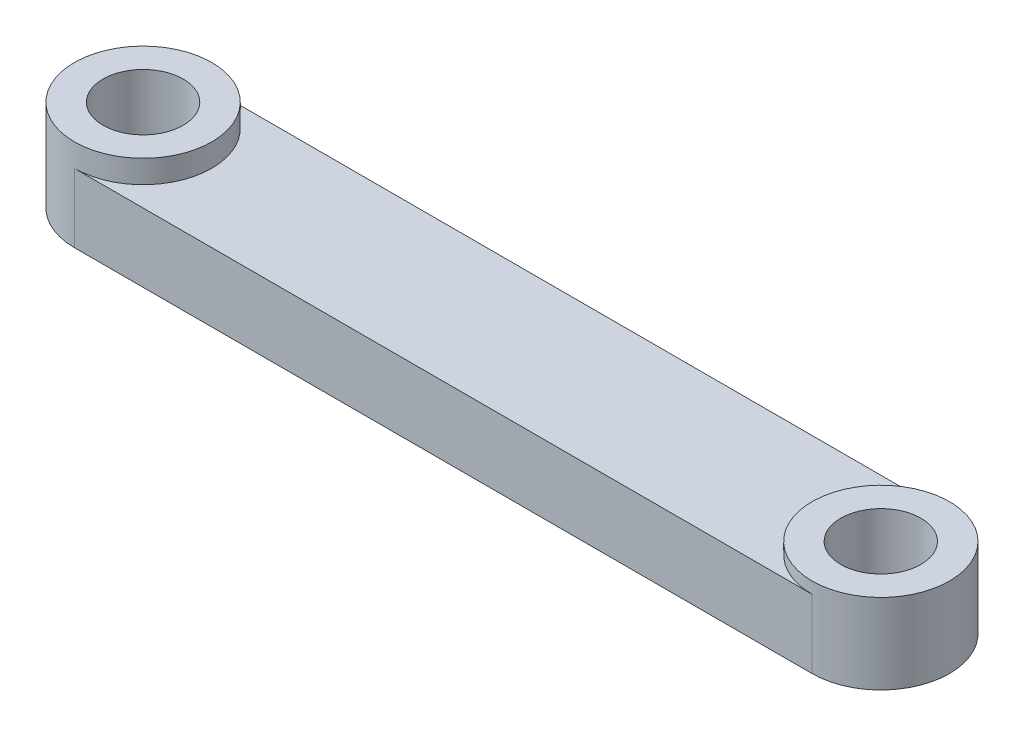
ISO-10303-21;
HEADER;
FILE_DESCRIPTION(('STEP AP214'),'2;1');
FILE_NAME('part.step','',(''),(''),'','','');
FILE_SCHEMA(('AUTOMOTIVE_DESIGN { 1 0 10303 214 1 1 1 1 }'));
ENDSEC;
DATA;
#1=APPLICATION_CONTEXT('core data for automotive mechanical design processes');
#2=APPLICATION_PROTOCOL_DEFINITION('international standard','automotive_design',2000,#1);
#3=PRODUCT_CONTEXT('',#1,'mechanical');
#4=PRODUCT('Part','Part','',(#3));
#5=PRODUCT_RELATED_PRODUCT_CATEGORY('part','',(#4));
#6=PRODUCT_DEFINITION_FORMATION('','',#4);
#7=PRODUCT_DEFINITION_CONTEXT('part definition',#1,'design');
#8=PRODUCT_DEFINITION('design','',#6,#7);
#9=PRODUCT_DEFINITION_SHAPE('','',#8);
#10=(LENGTH_UNIT() NAMED_UNIT(*) SI_UNIT(.MILLI.,.METRE.));
#11=(NAMED_UNIT(*) PLANE_ANGLE_UNIT() SI_UNIT($,.RADIAN.));
#12=(NAMED_UNIT(*) SI_UNIT($,.STERADIAN.) SOLID_ANGLE_UNIT());
#13=UNCERTAINTY_MEASURE_WITH_UNIT(LENGTH_MEASURE(1.E-05),#10,'distance_accuracy_value','');
#14=(GEOMETRIC_REPRESENTATION_CONTEXT(3) GLOBAL_UNCERTAINTY_ASSIGNED_CONTEXT((#13)) GLOBAL_UNIT_ASSIGNED_CONTEXT((#10,
#11,#12)) REPRESENTATION_CONTEXT('',''));
#15=CARTESIAN_POINT('',(0.,0.,0.));
#16=DIRECTION('',(0.,0.,1.));
#17=DIRECTION('',(1.,0.,0.));
#18=AXIS2_PLACEMENT_3D('',#15,#16,#17);
#19=CARTESIAN_POINT('',(0.,3.,0.));
#20=DIRECTION('',(0.,-1.,0.));
#21=DIRECTION('',(0.,0.,-1.));
#22=AXIS2_PLACEMENT_3D('',#19,#20,#21);
#23=CYLINDRICAL_SURFACE('',#22,3.);
#24=CARTESIAN_POINT('',(0.,0.,0.));
#25=DIRECTION('',(0.,1.,0.));
#26=DIRECTION('',(0.,0.,1.));
#27=AXIS2_PLACEMENT_3D('',#24,#25,#26);
#28=CIRCLE('',#27,3.);
#29=CARTESIAN_POINT('',(0.,0.,-3.));
#30=VERTEX_POINT('',#29);
#31=CARTESIAN_POINT('',(0.,0.,3.));
#32=VERTEX_POINT('',#31);
#33=EDGE_CURVE('E105',#30,#32,#28,.T.);
#34=ORIENTED_EDGE('',*,*,#33,.T.);
#35=DIRECTION('',(0.,-1.,0.));
#36=VECTOR('',#35,1.);
#37=CARTESIAN_POINT('',(0.,3.,3.));
#38=LINE('',#37,#36);
#39=CARTESIAN_POINT('',(0.,3.,3.));
#40=VERTEX_POINT('',#39);
#41=EDGE_CURVE('E58',#40,#32,#38,.T.);
#42=ORIENTED_EDGE('',*,*,#41,.F.);
#43=CARTESIAN_POINT('',(0.,3.,0.));
#44=DIRECTION('',(0.,1.,0.));
#45=DIRECTION('',(0.,0.,1.));
#46=AXIS2_PLACEMENT_3D('',#43,#44,#45);
#47=CIRCLE('',#46,3.);
#48=CARTESIAN_POINT('',(0.,3.,-3.));
#49=VERTEX_POINT('',#48);
#50=EDGE_CURVE('E106',#40,#49,#47,.T.);
#51=ORIENTED_EDGE('',*,*,#50,.T.);
#52=DIRECTION('',(0.,-1.,0.));
#53=VECTOR('',#52,1.);
#54=CARTESIAN_POINT('',(0.,3.,-3.));
#55=LINE('',#54,#53);
#56=EDGE_CURVE('E93',#49,#30,#55,.T.);
#57=ORIENTED_EDGE('',*,*,#56,.T.);
#58=EDGE_LOOP('',(#34,#42,#51,#57));
#59=FACE_BOUND('',#58,.T.);
#60=CARTESIAN_POINT('',(0.,4.,0.));
#61=DIRECTION('',(0.,1.,0.));
#62=DIRECTION('',(0.,0.,1.));
#63=AXIS2_PLACEMENT_3D('',#60,#61,#62);
#64=CIRCLE('',#63,3.);
#65=CARTESIAN_POINT('',(0.,4.,3.));
#66=VERTEX_POINT('',#65);
#67=EDGE_CURVE('E121',#66,#66,#64,.T.);
#68=ORIENTED_EDGE('',*,*,#67,.F.);
#69=EDGE_LOOP('',(#68));
#70=FACE_BOUND('',#69,.T.);
#71=ADVANCED_FACE('F48',(#59,#70),#23,.T.);
#72=CARTESIAN_POINT('',(0.,3.,3.));
#73=DIRECTION('',(0.,0.,-1.));
#74=DIRECTION('',(-1.,0.,0.));
#75=AXIS2_PLACEMENT_3D('',#72,#73,#74);
#76=PLANE('',#75);
#77=DIRECTION('',(1.,0.,0.));
#78=VECTOR('',#77,1.);
#79=CARTESIAN_POINT('',(0.,0.,3.));
#80=LINE('',#79,#78);
#81=CARTESIAN_POINT('',(32.2,0.,3.));
#82=VERTEX_POINT('',#81);
#83=EDGE_CURVE('E111',#32,#82,#80,.T.);
#84=ORIENTED_EDGE('',*,*,#83,.T.);
#85=DIRECTION('',(0.,-1.,0.));
#86=VECTOR('',#85,1.);
#87=CARTESIAN_POINT('',(32.2,3.,3.));
#88=LINE('',#87,#86);
#89=CARTESIAN_POINT('',(32.2,3.,3.));
#90=VERTEX_POINT('',#89);
#91=EDGE_CURVE('E128',#90,#82,#88,.T.);
#92=ORIENTED_EDGE('',*,*,#91,.F.);
#93=DIRECTION('',(1.,0.,0.));
#94=VECTOR('',#93,1.);
#95=CARTESIAN_POINT('',(0.,3.,3.));
#96=LINE('',#95,#94);
#97=EDGE_CURVE('E98',#40,#90,#96,.T.);
#98=ORIENTED_EDGE('',*,*,#97,.F.);
#99=ORIENTED_EDGE('',*,*,#41,.T.);
#100=EDGE_LOOP('',(#84,#92,#98,#99));
#101=FACE_BOUND('',#100,.T.);
#102=ADVANCED_FACE('F131',(#101),#76,.F.);
#103=CARTESIAN_POINT('',(32.2,3.,0.));
#104=DIRECTION('',(0.,-1.,0.));
#105=DIRECTION('',(0.,0.,-1.));
#106=AXIS2_PLACEMENT_3D('',#103,#104,#105);
#107=CYLINDRICAL_SURFACE('',#106,3.);
#108=CARTESIAN_POINT('',(32.2,0.,0.));
#109=DIRECTION('',(0.,1.,0.));
#110=DIRECTION('',(0.,0.,1.));
#111=AXIS2_PLACEMENT_3D('',#108,#109,#110);
#112=CIRCLE('',#111,3.);
#113=CARTESIAN_POINT('',(32.2,0.,-3.));
#114=VERTEX_POINT('',#113);
#115=EDGE_CURVE('E82',#82,#114,#112,.T.);
#116=ORIENTED_EDGE('',*,*,#115,.T.);
#117=DIRECTION('',(0.,-1.,0.));
#118=VECTOR('',#117,1.);
#119=CARTESIAN_POINT('',(32.2,3.,-3.));
#120=LINE('',#119,#118);
#121=CARTESIAN_POINT('',(32.2,3.,-3.));
#122=VERTEX_POINT('',#121);
#123=EDGE_CURVE('E94',#122,#114,#120,.T.);
#124=ORIENTED_EDGE('',*,*,#123,.F.);
#125=CARTESIAN_POINT('',(32.2,3.,0.));
#126=DIRECTION('',(0.,1.,0.));
#127=DIRECTION('',(0.,0.,1.));
#128=AXIS2_PLACEMENT_3D('',#125,#126,#127);
#129=CIRCLE('',#128,3.);
#130=EDGE_CURVE('E13',#122,#90,#129,.T.);
#131=ORIENTED_EDGE('',*,*,#130,.T.);
#132=ORIENTED_EDGE('',*,*,#91,.T.);
#133=EDGE_LOOP('',(#116,#124,#131,#132));
#134=FACE_BOUND('',#133,.T.);
#135=CARTESIAN_POINT('',(32.2,3.5,0.));
#136=DIRECTION('',(0.,1.,0.));
#137=DIRECTION('',(0.,0.,1.));
#138=AXIS2_PLACEMENT_3D('',#135,#136,#137);
#139=CIRCLE('',#138,3.);
#140=CARTESIAN_POINT('',(32.2,3.5,3.));
#141=VERTEX_POINT('',#140);
#142=EDGE_CURVE('E114',#141,#141,#139,.T.);
#143=ORIENTED_EDGE('',*,*,#142,.F.);
#144=EDGE_LOOP('',(#143));
#145=FACE_BOUND('',#144,.T.);
#146=ADVANCED_FACE('F167',(#134,#145),#107,.T.);
#147=CARTESIAN_POINT('',(0.,3.,-3.));
#148=DIRECTION('',(0.,0.,1.));
#149=DIRECTION('',(1.,0.,0.));
#150=AXIS2_PLACEMENT_3D('',#147,#148,#149);
#151=PLANE('',#150);
#152=DIRECTION('',(-1.,0.,0.));
#153=VECTOR('',#152,1.);
#154=CARTESIAN_POINT('',(0.,0.,-3.));
#155=LINE('',#154,#153);
#156=EDGE_CURVE('E88',#114,#30,#155,.T.);
#157=ORIENTED_EDGE('',*,*,#156,.T.);
#158=ORIENTED_EDGE('',*,*,#56,.F.);
#159=DIRECTION('',(-1.,0.,0.));
#160=VECTOR('',#159,1.);
#161=CARTESIAN_POINT('',(0.,3.,-3.));
#162=LINE('',#161,#160);
#163=EDGE_CURVE('E108',#122,#49,#162,.T.);
#164=ORIENTED_EDGE('',*,*,#163,.F.);
#165=ORIENTED_EDGE('',*,*,#123,.T.);
#166=EDGE_LOOP('',(#157,#158,#164,#165));
#167=FACE_BOUND('',#166,.T.);
#168=ADVANCED_FACE('F90',(#167),#151,.F.);
#169=CARTESIAN_POINT('',(0.,3.,0.));
#170=DIRECTION('',(0.,1.,0.));
#171=DIRECTION('',(0.,0.,1.));
#172=AXIS2_PLACEMENT_3D('',#169,#170,#171);
#173=PLANE('',#172);
#174=ORIENTED_EDGE('',*,*,#163,.T.);
#175=ORIENTED_EDGE('',*,*,#50,.F.);
#176=ORIENTED_EDGE('',*,*,#97,.T.);
#177=ORIENTED_EDGE('',*,*,#130,.F.);
#178=EDGE_LOOP('',(#174,#175,#176,#177));
#179=FACE_BOUND('',#178,.T.);
#180=ADVANCED_FACE('F174',(#179),#173,.T.);
#181=CARTESIAN_POINT('',(0.,0.,0.));
#182=DIRECTION('',(0.,1.,0.));
#183=DIRECTION('',(0.,0.,1.));
#184=AXIS2_PLACEMENT_3D('',#181,#182,#183);
#185=PLANE('',#184);
#186=CARTESIAN_POINT('',(0.,0.,0.));
#187=DIRECTION('',(0.,1.,0.));
#188=DIRECTION('',(0.,0.,1.));
#189=AXIS2_PLACEMENT_3D('',#186,#187,#188);
#190=CIRCLE('',#189,1.75);
#191=CARTESIAN_POINT('',(0.,0.,1.75));
#192=VERTEX_POINT('',#191);
#193=EDGE_CURVE('E149',#192,#192,#190,.T.);
#194=ORIENTED_EDGE('',*,*,#193,.T.);
#195=EDGE_LOOP('',(#194));
#196=FACE_BOUND('',#195,.T.);
#197=CARTESIAN_POINT('',(32.2,0.,0.));
#198=DIRECTION('',(0.,1.,0.));
#199=DIRECTION('',(0.,0.,1.));
#200=AXIS2_PLACEMENT_3D('',#197,#198,#199);
#201=CIRCLE('',#200,1.75);
#202=CARTESIAN_POINT('',(32.2,0.,1.75));
#203=VERTEX_POINT('',#202);
#204=EDGE_CURVE('E141',#203,#203,#201,.T.);
#205=ORIENTED_EDGE('',*,*,#204,.T.);
#206=EDGE_LOOP('',(#205));
#207=FACE_BOUND('',#206,.T.);
#208=ORIENTED_EDGE('',*,*,#33,.F.);
#209=ORIENTED_EDGE('',*,*,#156,.F.);
#210=ORIENTED_EDGE('',*,*,#115,.F.);
#211=ORIENTED_EDGE('',*,*,#83,.F.);
#212=EDGE_LOOP('',(#208,#209,#210,#211));
#213=FACE_BOUND('',#212,.T.);
#214=ADVANCED_FACE('F110',(#196,#207,#213),#185,.F.);
#215=CARTESIAN_POINT('',(32.2,3.5,0.));
#216=DIRECTION('',(0.,1.,0.));
#217=DIRECTION('',(0.,0.,1.));
#218=AXIS2_PLACEMENT_3D('',#215,#216,#217);
#219=PLANE('',#218);
#220=CARTESIAN_POINT('',(32.2,3.5,0.));
#221=DIRECTION('',(0.,1.,0.));
#222=DIRECTION('',(0.,0.,1.));
#223=AXIS2_PLACEMENT_3D('',#220,#221,#222);
#224=CIRCLE('',#223,1.75);
#225=CARTESIAN_POINT('',(32.2,3.5,1.75));
#226=VERTEX_POINT('',#225);
#227=EDGE_CURVE('E51',#226,#226,#224,.T.);
#228=ORIENTED_EDGE('',*,*,#227,.F.);
#229=EDGE_LOOP('',(#228));
#230=FACE_BOUND('',#229,.T.);
#231=ORIENTED_EDGE('',*,*,#142,.T.);
#232=EDGE_LOOP('',(#231));
#233=FACE_BOUND('',#232,.T.);
#234=ADVANCED_FACE('F160',(#230,#233),#219,.T.);
#235=CARTESIAN_POINT('',(0.,4.,0.));
#236=DIRECTION('',(0.,1.,0.));
#237=DIRECTION('',(0.,0.,1.));
#238=AXIS2_PLACEMENT_3D('',#235,#236,#237);
#239=PLANE('',#238);
#240=CARTESIAN_POINT('',(0.,4.,0.));
#241=DIRECTION('',(0.,1.,0.));
#242=DIRECTION('',(0.,0.,1.));
#243=AXIS2_PLACEMENT_3D('',#240,#241,#242);
#244=CIRCLE('',#243,1.75);
#245=CARTESIAN_POINT('',(0.,4.,1.75));
#246=VERTEX_POINT('',#245);
#247=EDGE_CURVE('E145',#246,#246,#244,.T.);
#248=ORIENTED_EDGE('',*,*,#247,.F.);
#249=EDGE_LOOP('',(#248));
#250=FACE_BOUND('',#249,.T.);
#251=ORIENTED_EDGE('',*,*,#67,.T.);
#252=EDGE_LOOP('',(#251));
#253=FACE_BOUND('',#252,.T.);
#254=ADVANCED_FACE('F163',(#250,#253),#239,.T.);
#255=CARTESIAN_POINT('',(0.,0.,0.));
#256=DIRECTION('',(0.,1.,0.));
#257=DIRECTION('',(0.,0.,1.));
#258=AXIS2_PLACEMENT_3D('',#255,#256,#257);
#259=CYLINDRICAL_SURFACE('',#258,1.75);
#260=ORIENTED_EDGE('',*,*,#193,.F.);
#261=EDGE_LOOP('',(#260));
#262=FACE_BOUND('',#261,.T.);
#263=ORIENTED_EDGE('',*,*,#247,.T.);
#264=EDGE_LOOP('',(#263));
#265=FACE_BOUND('',#264,.T.);
#266=ADVANCED_FACE('F225',(#262,#265),#259,.F.);
#267=CARTESIAN_POINT('',(32.2,0.,0.));
#268=DIRECTION('',(0.,1.,0.));
#269=DIRECTION('',(0.,0.,1.));
#270=AXIS2_PLACEMENT_3D('',#267,#268,#269);
#271=CYLINDRICAL_SURFACE('',#270,1.75);
#272=ORIENTED_EDGE('',*,*,#227,.T.);
#273=EDGE_LOOP('',(#272));
#274=FACE_BOUND('',#273,.T.);
#275=ORIENTED_EDGE('',*,*,#204,.F.);
#276=EDGE_LOOP('',(#275));
#277=FACE_BOUND('',#276,.T.);
#278=ADVANCED_FACE('F157',(#274,#277),#271,.F.);
#279=CLOSED_SHELL('',(#71,#102,#146,#168,#180,#214,#234,#254,#266,#278));
#280=MANIFOLD_SOLID_BREP('B2',#279);
#281=ADVANCED_BREP_SHAPE_REPRESENTATION('',(#18,#280),#14);
#282=SHAPE_DEFINITION_REPRESENTATION(#9,#281);
ENDSEC;
END-ISO-10303-21;
